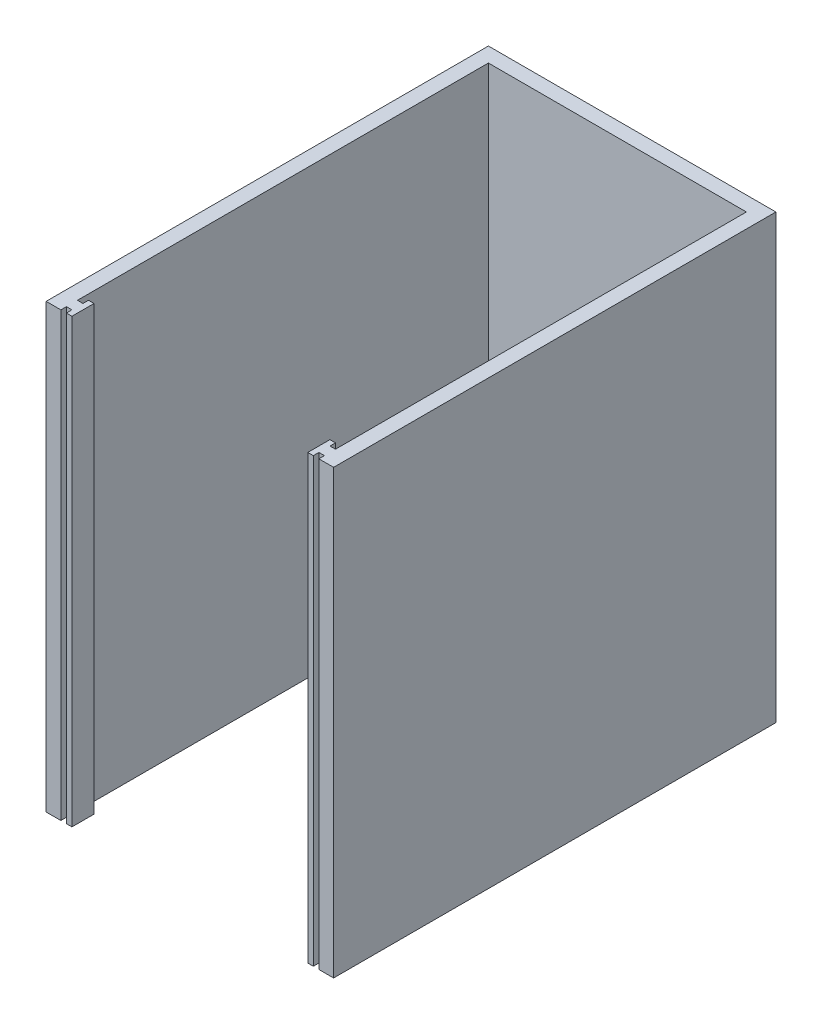
ISO-10303-21;
HEADER;
FILE_DESCRIPTION(('STEP AP214'),'2;1');
FILE_NAME('part.step','',(''),(''),'','','');
FILE_SCHEMA(('AUTOMOTIVE_DESIGN { 1 0 10303 214 1 1 1 1 }'));
ENDSEC;
DATA;
#1=APPLICATION_CONTEXT('core data for automotive mechanical design processes');
#2=APPLICATION_PROTOCOL_DEFINITION('international standard','automotive_design',2000,#1);
#3=PRODUCT_CONTEXT('',#1,'mechanical');
#4=PRODUCT('Part','Part','',(#3));
#5=PRODUCT_RELATED_PRODUCT_CATEGORY('part','',(#4));
#6=PRODUCT_DEFINITION_FORMATION('','',#4);
#7=PRODUCT_DEFINITION_CONTEXT('part definition',#1,'design');
#8=PRODUCT_DEFINITION('design','',#6,#7);
#9=PRODUCT_DEFINITION_SHAPE('','',#8);
#10=(LENGTH_UNIT() NAMED_UNIT(*) SI_UNIT(.MILLI.,.METRE.));
#11=(NAMED_UNIT(*) PLANE_ANGLE_UNIT() SI_UNIT($,.RADIAN.));
#12=(NAMED_UNIT(*) SI_UNIT($,.STERADIAN.) SOLID_ANGLE_UNIT());
#13=UNCERTAINTY_MEASURE_WITH_UNIT(LENGTH_MEASURE(1.E-05),#10,'distance_accuracy_value','');
#14=(GEOMETRIC_REPRESENTATION_CONTEXT(3) GLOBAL_UNCERTAINTY_ASSIGNED_CONTEXT((#13)) GLOBAL_UNIT_ASSIGNED_CONTEXT((#10,
#11,#12)) REPRESENTATION_CONTEXT('',''));
#15=CARTESIAN_POINT('',(0.,0.,0.));
#16=DIRECTION('',(0.,0.,1.));
#17=DIRECTION('',(1.,0.,0.));
#18=AXIS2_PLACEMENT_3D('',#15,#16,#17);
#19=CARTESIAN_POINT('',(0.,120.,0.));
#20=DIRECTION('',(1.,0.,0.));
#21=DIRECTION('',(0.,0.,-1.));
#22=AXIS2_PLACEMENT_3D('',#19,#20,#21);
#23=PLANE('',#22);
#24=DIRECTION('',(0.,0.,1.));
#25=VECTOR('',#24,1.);
#26=CARTESIAN_POINT('',(0.,0.,0.));
#27=LINE('',#26,#25);
#28=CARTESIAN_POINT('',(0.,0.,0.));
#29=VERTEX_POINT('',#28);
#30=CARTESIAN_POINT('',(0.,0.,120.));
#31=VERTEX_POINT('',#30);
#32=EDGE_CURVE('E236',#29,#31,#27,.T.);
#33=ORIENTED_EDGE('',*,*,#32,.T.);
#34=DIRECTION('',(0.,-1.,0.));
#35=VECTOR('',#34,1.);
#36=CARTESIAN_POINT('',(0.,120.,120.));
#37=LINE('',#36,#35);
#38=CARTESIAN_POINT('',(0.,120.,120.));
#39=VERTEX_POINT('',#38);
#40=EDGE_CURVE('E11',#39,#31,#37,.T.);
#41=ORIENTED_EDGE('',*,*,#40,.F.);
#42=DIRECTION('',(0.,0.,1.));
#43=VECTOR('',#42,1.);
#44=CARTESIAN_POINT('',(0.,120.,0.));
#45=LINE('',#44,#43);
#46=CARTESIAN_POINT('',(0.,120.,0.));
#47=VERTEX_POINT('',#46);
#48=EDGE_CURVE('E306',#47,#39,#45,.T.);
#49=ORIENTED_EDGE('',*,*,#48,.F.);
#50=DIRECTION('',(0.,-1.,0.));
#51=VECTOR('',#50,1.);
#52=CARTESIAN_POINT('',(0.,120.,0.));
#53=LINE('',#52,#51);
#54=EDGE_CURVE('E232',#47,#29,#53,.T.);
#55=ORIENTED_EDGE('',*,*,#54,.T.);
#56=EDGE_LOOP('',(#33,#41,#49,#55));
#57=FACE_BOUND('',#56,.T.);
#58=ADVANCED_FACE('F39',(#57),#23,.F.);
#59=CARTESIAN_POINT('',(0.,120.,120.));
#60=DIRECTION('',(0.,0.,-1.));
#61=DIRECTION('',(-1.,0.,0.));
#62=AXIS2_PLACEMENT_3D('',#59,#60,#61);
#63=PLANE('',#62);
#64=DIRECTION('',(1.,0.,0.));
#65=VECTOR('',#64,1.);
#66=CARTESIAN_POINT('',(0.,0.,120.));
#67=LINE('',#66,#65);
#68=CARTESIAN_POINT('',(4.00000000000001,0.,120.));
#69=VERTEX_POINT('',#68);
#70=EDGE_CURVE('E240',#31,#69,#67,.T.);
#71=ORIENTED_EDGE('',*,*,#70,.T.);
#72=DIRECTION('',(0.,-1.,0.));
#73=VECTOR('',#72,1.);
#74=CARTESIAN_POINT('',(4.00000000000001,120.,120.));
#75=LINE('',#74,#73);
#76=CARTESIAN_POINT('',(4.00000000000001,120.,120.));
#77=VERTEX_POINT('',#76);
#78=EDGE_CURVE('E48',#77,#69,#75,.T.);
#79=ORIENTED_EDGE('',*,*,#78,.F.);
#80=DIRECTION('',(1.,0.,0.));
#81=VECTOR('',#80,1.);
#82=CARTESIAN_POINT('',(0.,120.,120.));
#83=LINE('',#82,#81);
#84=EDGE_CURVE('E147',#39,#77,#83,.T.);
#85=ORIENTED_EDGE('',*,*,#84,.F.);
#86=ORIENTED_EDGE('',*,*,#40,.T.);
#87=EDGE_LOOP('',(#71,#79,#85,#86));
#88=FACE_BOUND('',#87,.T.);
#89=ADVANCED_FACE('F484',(#88),#63,.F.);
#90=CARTESIAN_POINT('',(4.00000000000001,120.,120.));
#91=DIRECTION('',(-1.,0.,0.));
#92=DIRECTION('',(0.,0.,1.));
#93=AXIS2_PLACEMENT_3D('',#90,#91,#92);
#94=PLANE('',#93);
#95=DIRECTION('',(0.,0.,-1.));
#96=VECTOR('',#95,1.);
#97=CARTESIAN_POINT('',(4.00000000000001,0.,120.));
#98=LINE('',#97,#96);
#99=CARTESIAN_POINT('',(4.00000000000002,0.,118.5));
#100=VERTEX_POINT('',#99);
#101=EDGE_CURVE('E243',#69,#100,#98,.T.);
#102=ORIENTED_EDGE('',*,*,#101,.T.);
#103=DIRECTION('',(0.,-1.,0.));
#104=VECTOR('',#103,1.);
#105=CARTESIAN_POINT('',(4.00000000000002,120.,118.5));
#106=LINE('',#105,#104);
#107=CARTESIAN_POINT('',(4.00000000000002,120.,118.5));
#108=VERTEX_POINT('',#107);
#109=EDGE_CURVE('E381',#108,#100,#106,.T.);
#110=ORIENTED_EDGE('',*,*,#109,.F.);
#111=DIRECTION('',(0.,0.,-1.));
#112=VECTOR('',#111,1.);
#113=CARTESIAN_POINT('',(4.00000000000001,120.,120.));
#114=LINE('',#113,#112);
#115=EDGE_CURVE('E391',#77,#108,#114,.T.);
#116=ORIENTED_EDGE('',*,*,#115,.F.);
#117=ORIENTED_EDGE('',*,*,#78,.T.);
#118=EDGE_LOOP('',(#102,#110,#116,#117));
#119=FACE_BOUND('',#118,.T.);
#120=ADVANCED_FACE('F389',(#119),#94,.F.);
#121=CARTESIAN_POINT('',(5.50000000000002,120.,118.5));
#122=DIRECTION('',(0.,0.,-1.));
#123=DIRECTION('',(-1.,0.,0.));
#124=AXIS2_PLACEMENT_3D('',#121,#122,#123);
#125=PLANE('',#124);
#126=DIRECTION('',(1.,0.,0.));
#127=VECTOR('',#126,1.);
#128=CARTESIAN_POINT('',(5.50000000000002,0.,118.5));
#129=LINE('',#128,#127);
#130=CARTESIAN_POINT('',(5.50000000000002,0.,118.5));
#131=VERTEX_POINT('',#130);
#132=EDGE_CURVE('E246',#100,#131,#129,.T.);
#133=ORIENTED_EDGE('',*,*,#132,.T.);
#134=DIRECTION('',(0.,-1.,0.));
#135=VECTOR('',#134,1.);
#136=CARTESIAN_POINT('',(5.50000000000002,120.,118.5));
#137=LINE('',#136,#135);
#138=CARTESIAN_POINT('',(5.50000000000002,120.,118.5));
#139=VERTEX_POINT('',#138);
#140=EDGE_CURVE('E377',#139,#131,#137,.T.);
#141=ORIENTED_EDGE('',*,*,#140,.F.);
#142=DIRECTION('',(1.,0.,0.));
#143=VECTOR('',#142,1.);
#144=CARTESIAN_POINT('',(5.50000000000002,120.,118.5));
#145=LINE('',#144,#143);
#146=EDGE_CURVE('E410',#108,#139,#145,.T.);
#147=ORIENTED_EDGE('',*,*,#146,.F.);
#148=ORIENTED_EDGE('',*,*,#109,.T.);
#149=EDGE_LOOP('',(#133,#141,#147,#148));
#150=FACE_BOUND('',#149,.T.);
#151=ADVANCED_FACE('F400',(#150),#125,.F.);
#152=CARTESIAN_POINT('',(5.50000000000002,120.,120.));
#153=DIRECTION('',(1.,0.,0.));
#154=DIRECTION('',(0.,0.,-1.));
#155=AXIS2_PLACEMENT_3D('',#152,#153,#154);
#156=PLANE('',#155);
#157=DIRECTION('',(0.,0.,1.));
#158=VECTOR('',#157,1.);
#159=CARTESIAN_POINT('',(5.50000000000002,0.,120.));
#160=LINE('',#159,#158);
#161=CARTESIAN_POINT('',(5.50000000000002,0.,120.));
#162=VERTEX_POINT('',#161);
#163=EDGE_CURVE('E249',#131,#162,#160,.T.);
#164=ORIENTED_EDGE('',*,*,#163,.T.);
#165=DIRECTION('',(0.,-1.,0.));
#166=VECTOR('',#165,1.);
#167=CARTESIAN_POINT('',(5.50000000000002,120.,120.));
#168=LINE('',#167,#166);
#169=CARTESIAN_POINT('',(5.50000000000002,120.,120.));
#170=VERTEX_POINT('',#169);
#171=EDGE_CURVE('E373',#170,#162,#168,.T.);
#172=ORIENTED_EDGE('',*,*,#171,.F.);
#173=DIRECTION('',(0.,0.,1.));
#174=VECTOR('',#173,1.);
#175=CARTESIAN_POINT('',(5.50000000000002,120.,120.));
#176=LINE('',#175,#174);
#177=EDGE_CURVE('E406',#139,#170,#176,.T.);
#178=ORIENTED_EDGE('',*,*,#177,.F.);
#179=ORIENTED_EDGE('',*,*,#140,.T.);
#180=EDGE_LOOP('',(#164,#172,#178,#179));
#181=FACE_BOUND('',#180,.T.);
#182=ADVANCED_FACE('F404',(#181),#156,.F.);
#183=CARTESIAN_POINT('',(5.50000000000002,120.,120.));
#184=DIRECTION('',(0.,0.,-1.));
#185=DIRECTION('',(-1.,0.,0.));
#186=AXIS2_PLACEMENT_3D('',#183,#184,#185);
#187=PLANE('',#186);
#188=DIRECTION('',(1.,0.,0.));
#189=VECTOR('',#188,1.);
#190=CARTESIAN_POINT('',(5.50000000000002,0.,120.));
#191=LINE('',#190,#189);
#192=CARTESIAN_POINT('',(7.00000000000002,0.,120.));
#193=VERTEX_POINT('',#192);
#194=EDGE_CURVE('E252',#162,#193,#191,.T.);
#195=ORIENTED_EDGE('',*,*,#194,.T.);
#196=DIRECTION('',(0.,-1.,0.));
#197=VECTOR('',#196,1.);
#198=CARTESIAN_POINT('',(7.00000000000002,120.,120.));
#199=LINE('',#198,#197);
#200=CARTESIAN_POINT('',(7.00000000000002,120.,120.));
#201=VERTEX_POINT('',#200);
#202=EDGE_CURVE('E369',#201,#193,#199,.T.);
#203=ORIENTED_EDGE('',*,*,#202,.F.);
#204=DIRECTION('',(1.,0.,0.));
#205=VECTOR('',#204,1.);
#206=CARTESIAN_POINT('',(5.50000000000002,120.,120.));
#207=LINE('',#206,#205);
#208=EDGE_CURVE('E409',#170,#201,#207,.T.);
#209=ORIENTED_EDGE('',*,*,#208,.F.);
#210=ORIENTED_EDGE('',*,*,#171,.T.);
#211=EDGE_LOOP('',(#195,#203,#209,#210));
#212=FACE_BOUND('',#211,.T.);
#213=ADVANCED_FACE('F497',(#212),#187,.F.);
#214=CARTESIAN_POINT('',(7.00000000000002,120.,120.));
#215=DIRECTION('',(-1.,0.,0.));
#216=DIRECTION('',(0.,0.,1.));
#217=AXIS2_PLACEMENT_3D('',#214,#215,#216);
#218=PLANE('',#217);
#219=DIRECTION('',(0.,0.,-1.));
#220=VECTOR('',#219,1.);
#221=CARTESIAN_POINT('',(7.00000000000002,0.,120.));
#222=LINE('',#221,#220);
#223=CARTESIAN_POINT('',(7.00000000000002,0.,114.));
#224=VERTEX_POINT('',#223);
#225=EDGE_CURVE('E255',#193,#224,#222,.T.);
#226=ORIENTED_EDGE('',*,*,#225,.T.);
#227=DIRECTION('',(0.,-1.,0.));
#228=VECTOR('',#227,1.);
#229=CARTESIAN_POINT('',(7.00000000000002,120.,114.));
#230=LINE('',#229,#228);
#231=CARTESIAN_POINT('',(7.00000000000002,120.,114.));
#232=VERTEX_POINT('',#231);
#233=EDGE_CURVE('E365',#232,#224,#230,.T.);
#234=ORIENTED_EDGE('',*,*,#233,.F.);
#235=DIRECTION('',(0.,0.,-1.));
#236=VECTOR('',#235,1.);
#237=CARTESIAN_POINT('',(7.00000000000002,120.,120.));
#238=LINE('',#237,#236);
#239=EDGE_CURVE('E414',#201,#232,#238,.T.);
#240=ORIENTED_EDGE('',*,*,#239,.F.);
#241=ORIENTED_EDGE('',*,*,#202,.T.);
#242=EDGE_LOOP('',(#226,#234,#240,#241));
#243=FACE_BOUND('',#242,.T.);
#244=ADVANCED_FACE('F500',(#243),#218,.F.);
#245=CARTESIAN_POINT('',(5.50000000000001,120.,114.));
#246=DIRECTION('',(0.,0.,1.));
#247=DIRECTION('',(1.,0.,0.));
#248=AXIS2_PLACEMENT_3D('',#245,#246,#247);
#249=PLANE('',#248);
#250=DIRECTION('',(-1.,0.,0.));
#251=VECTOR('',#250,1.);
#252=CARTESIAN_POINT('',(5.50000000000001,0.,114.));
#253=LINE('',#252,#251);
#254=CARTESIAN_POINT('',(5.50000000000001,0.,114.));
#255=VERTEX_POINT('',#254);
#256=EDGE_CURVE('E258',#224,#255,#253,.T.);
#257=ORIENTED_EDGE('',*,*,#256,.T.);
#258=DIRECTION('',(0.,-1.,0.));
#259=VECTOR('',#258,1.);
#260=CARTESIAN_POINT('',(5.50000000000001,120.,114.));
#261=LINE('',#260,#259);
#262=CARTESIAN_POINT('',(5.50000000000001,120.,114.));
#263=VERTEX_POINT('',#262);
#264=EDGE_CURVE('E361',#263,#255,#261,.T.);
#265=ORIENTED_EDGE('',*,*,#264,.F.);
#266=DIRECTION('',(-1.,0.,0.));
#267=VECTOR('',#266,1.);
#268=CARTESIAN_POINT('',(5.50000000000001,120.,114.));
#269=LINE('',#268,#267);
#270=EDGE_CURVE('E421',#232,#263,#269,.T.);
#271=ORIENTED_EDGE('',*,*,#270,.F.);
#272=ORIENTED_EDGE('',*,*,#233,.T.);
#273=EDGE_LOOP('',(#257,#265,#271,#272));
#274=FACE_BOUND('',#273,.T.);
#275=ADVANCED_FACE('F504',(#274),#249,.F.);
#276=CARTESIAN_POINT('',(5.50000000000001,120.,114.));
#277=DIRECTION('',(1.,0.,0.));
#278=DIRECTION('',(0.,0.,-1.));
#279=AXIS2_PLACEMENT_3D('',#276,#277,#278);
#280=PLANE('',#279);
#281=DIRECTION('',(0.,0.,1.));
#282=VECTOR('',#281,1.);
#283=CARTESIAN_POINT('',(5.50000000000001,0.,114.));
#284=LINE('',#283,#282);
#285=CARTESIAN_POINT('',(5.50000000000001,0.,115.5));
#286=VERTEX_POINT('',#285);
#287=EDGE_CURVE('E261',#255,#286,#284,.T.);
#288=ORIENTED_EDGE('',*,*,#287,.T.);
#289=DIRECTION('',(0.,-1.,0.));
#290=VECTOR('',#289,1.);
#291=CARTESIAN_POINT('',(5.50000000000001,120.,115.5));
#292=LINE('',#291,#290);
#293=CARTESIAN_POINT('',(5.50000000000001,120.,115.5));
#294=VERTEX_POINT('',#293);
#295=EDGE_CURVE('E357',#294,#286,#292,.T.);
#296=ORIENTED_EDGE('',*,*,#295,.F.);
#297=DIRECTION('',(0.,0.,1.));
#298=VECTOR('',#297,1.);
#299=CARTESIAN_POINT('',(5.50000000000001,120.,114.));
#300=LINE('',#299,#298);
#301=EDGE_CURVE('E424',#263,#294,#300,.T.);
#302=ORIENTED_EDGE('',*,*,#301,.F.);
#303=ORIENTED_EDGE('',*,*,#264,.T.);
#304=EDGE_LOOP('',(#288,#296,#302,#303));
#305=FACE_BOUND('',#304,.T.);
#306=ADVANCED_FACE('F508',(#305),#280,.F.);
#307=CARTESIAN_POINT('',(5.50000000000001,120.,115.5));
#308=DIRECTION('',(0.,0.,1.));
#309=DIRECTION('',(1.,0.,0.));
#310=AXIS2_PLACEMENT_3D('',#307,#308,#309);
#311=PLANE('',#310);
#312=DIRECTION('',(-1.,0.,0.));
#313=VECTOR('',#312,1.);
#314=CARTESIAN_POINT('',(5.50000000000001,0.,115.5));
#315=LINE('',#314,#313);
#316=CARTESIAN_POINT('',(4.00000000000002,0.,115.5));
#317=VERTEX_POINT('',#316);
#318=EDGE_CURVE('E264',#286,#317,#315,.T.);
#319=ORIENTED_EDGE('',*,*,#318,.T.);
#320=DIRECTION('',(0.,-1.,0.));
#321=VECTOR('',#320,1.);
#322=CARTESIAN_POINT('',(4.00000000000002,120.,115.5));
#323=LINE('',#322,#321);
#324=CARTESIAN_POINT('',(4.00000000000002,120.,115.5));
#325=VERTEX_POINT('',#324);
#326=EDGE_CURVE('E353',#325,#317,#323,.T.);
#327=ORIENTED_EDGE('',*,*,#326,.F.);
#328=DIRECTION('',(-1.,0.,0.));
#329=VECTOR('',#328,1.);
#330=CARTESIAN_POINT('',(5.50000000000001,120.,115.5));
#331=LINE('',#330,#329);
#332=EDGE_CURVE('E427',#294,#325,#331,.T.);
#333=ORIENTED_EDGE('',*,*,#332,.F.);
#334=ORIENTED_EDGE('',*,*,#295,.T.);
#335=EDGE_LOOP('',(#319,#327,#333,#334));
#336=FACE_BOUND('',#335,.T.);
#337=ADVANCED_FACE('F512',(#336),#311,.F.);
#338=CARTESIAN_POINT('',(4.00000000000002,120.,115.5));
#339=DIRECTION('',(-1.,0.,0.));
#340=DIRECTION('',(0.,0.,1.));
#341=AXIS2_PLACEMENT_3D('',#338,#339,#340);
#342=PLANE('',#341);
#343=DIRECTION('',(0.,0.,-1.));
#344=VECTOR('',#343,1.);
#345=CARTESIAN_POINT('',(4.00000000000002,0.,115.5));
#346=LINE('',#345,#344);
#347=CARTESIAN_POINT('',(4.00000000000002,0.,4.));
#348=VERTEX_POINT('',#347);
#349=EDGE_CURVE('E267',#317,#348,#346,.T.);
#350=ORIENTED_EDGE('',*,*,#349,.T.);
#351=DIRECTION('',(0.,-1.,0.));
#352=VECTOR('',#351,1.);
#353=CARTESIAN_POINT('',(4.00000000000002,120.,4.));
#354=LINE('',#353,#352);
#355=CARTESIAN_POINT('',(4.00000000000002,120.,4.));
#356=VERTEX_POINT('',#355);
#357=EDGE_CURVE('E349',#356,#348,#354,.T.);
#358=ORIENTED_EDGE('',*,*,#357,.F.);
#359=DIRECTION('',(0.,0.,-1.));
#360=VECTOR('',#359,1.);
#361=CARTESIAN_POINT('',(4.00000000000002,120.,115.5));
#362=LINE('',#361,#360);
#363=EDGE_CURVE('E430',#325,#356,#362,.T.);
#364=ORIENTED_EDGE('',*,*,#363,.F.);
#365=ORIENTED_EDGE('',*,*,#326,.T.);
#366=EDGE_LOOP('',(#350,#358,#364,#365));
#367=FACE_BOUND('',#366,.T.);
#368=ADVANCED_FACE('F516',(#367),#342,.F.);
#369=CARTESIAN_POINT('',(4.00000000000002,120.,4.));
#370=DIRECTION('',(0.,0.,-1.));
#371=DIRECTION('',(-1.,0.,0.));
#372=AXIS2_PLACEMENT_3D('',#369,#370,#371);
#373=PLANE('',#372);
#374=DIRECTION('',(1.,0.,0.));
#375=VECTOR('',#374,1.);
#376=CARTESIAN_POINT('',(4.00000000000002,0.,4.));
#377=LINE('',#376,#375);
#378=CARTESIAN_POINT('',(74.,0.,4.));
#379=VERTEX_POINT('',#378);
#380=EDGE_CURVE('E270',#348,#379,#377,.T.);
#381=ORIENTED_EDGE('',*,*,#380,.T.);
#382=DIRECTION('',(0.,-1.,0.));
#383=VECTOR('',#382,1.);
#384=CARTESIAN_POINT('',(74.,120.,4.));
#385=LINE('',#384,#383);
#386=CARTESIAN_POINT('',(74.,120.,4.));
#387=VERTEX_POINT('',#386);
#388=EDGE_CURVE('E345',#387,#379,#385,.T.);
#389=ORIENTED_EDGE('',*,*,#388,.F.);
#390=DIRECTION('',(1.,0.,0.));
#391=VECTOR('',#390,1.);
#392=CARTESIAN_POINT('',(4.00000000000002,120.,4.));
#393=LINE('',#392,#391);
#394=EDGE_CURVE('E433',#356,#387,#393,.T.);
#395=ORIENTED_EDGE('',*,*,#394,.F.);
#396=ORIENTED_EDGE('',*,*,#357,.T.);
#397=EDGE_LOOP('',(#381,#389,#395,#396));
#398=FACE_BOUND('',#397,.T.);
#399=ADVANCED_FACE('F520',(#398),#373,.F.);
#400=CARTESIAN_POINT('',(74.,120.,115.5));
#401=DIRECTION('',(1.,0.,0.));
#402=DIRECTION('',(0.,0.,-1.));
#403=AXIS2_PLACEMENT_3D('',#400,#401,#402);
#404=PLANE('',#403);
#405=DIRECTION('',(0.,0.,1.));
#406=VECTOR('',#405,1.);
#407=CARTESIAN_POINT('',(74.,0.,115.5));
#408=LINE('',#407,#406);
#409=CARTESIAN_POINT('',(74.,0.,115.5));
#410=VERTEX_POINT('',#409);
#411=EDGE_CURVE('E273',#379,#410,#408,.T.);
#412=ORIENTED_EDGE('',*,*,#411,.T.);
#413=DIRECTION('',(0.,-1.,0.));
#414=VECTOR('',#413,1.);
#415=CARTESIAN_POINT('',(74.,120.,115.5));
#416=LINE('',#415,#414);
#417=CARTESIAN_POINT('',(74.,120.,115.5));
#418=VERTEX_POINT('',#417);
#419=EDGE_CURVE('E341',#418,#410,#416,.T.);
#420=ORIENTED_EDGE('',*,*,#419,.F.);
#421=DIRECTION('',(0.,0.,1.));
#422=VECTOR('',#421,1.);
#423=CARTESIAN_POINT('',(74.,120.,115.5));
#424=LINE('',#423,#422);
#425=EDGE_CURVE('E436',#387,#418,#424,.T.);
#426=ORIENTED_EDGE('',*,*,#425,.F.);
#427=ORIENTED_EDGE('',*,*,#388,.T.);
#428=EDGE_LOOP('',(#412,#420,#426,#427));
#429=FACE_BOUND('',#428,.T.);
#430=ADVANCED_FACE('F524',(#429),#404,.F.);
#431=CARTESIAN_POINT('',(72.5,120.,115.5));
#432=DIRECTION('',(0.,0.,1.));
#433=DIRECTION('',(1.,0.,0.));
#434=AXIS2_PLACEMENT_3D('',#431,#432,#433);
#435=PLANE('',#434);
#436=DIRECTION('',(-1.,0.,0.));
#437=VECTOR('',#436,1.);
#438=CARTESIAN_POINT('',(72.5,0.,115.5));
#439=LINE('',#438,#437);
#440=CARTESIAN_POINT('',(72.5,0.,115.5));
#441=VERTEX_POINT('',#440);
#442=EDGE_CURVE('E276',#410,#441,#439,.T.);
#443=ORIENTED_EDGE('',*,*,#442,.T.);
#444=DIRECTION('',(0.,-1.,0.));
#445=VECTOR('',#444,1.);
#446=CARTESIAN_POINT('',(72.5,120.,115.5));
#447=LINE('',#446,#445);
#448=CARTESIAN_POINT('',(72.5,120.,115.5));
#449=VERTEX_POINT('',#448);
#450=EDGE_CURVE('E337',#449,#441,#447,.T.);
#451=ORIENTED_EDGE('',*,*,#450,.F.);
#452=DIRECTION('',(-1.,0.,0.));
#453=VECTOR('',#452,1.);
#454=CARTESIAN_POINT('',(72.5,120.,115.5));
#455=LINE('',#454,#453);
#456=EDGE_CURVE('E439',#418,#449,#455,.T.);
#457=ORIENTED_EDGE('',*,*,#456,.F.);
#458=ORIENTED_EDGE('',*,*,#419,.T.);
#459=EDGE_LOOP('',(#443,#451,#457,#458));
#460=FACE_BOUND('',#459,.T.);
#461=ADVANCED_FACE('F528',(#460),#435,.F.);
#462=CARTESIAN_POINT('',(72.5,120.,114.));
#463=DIRECTION('',(-1.,0.,0.));
#464=DIRECTION('',(0.,0.,1.));
#465=AXIS2_PLACEMENT_3D('',#462,#463,#464);
#466=PLANE('',#465);
#467=DIRECTION('',(0.,0.,-1.));
#468=VECTOR('',#467,1.);
#469=CARTESIAN_POINT('',(72.5,0.,114.));
#470=LINE('',#469,#468);
#471=CARTESIAN_POINT('',(72.5,0.,114.));
#472=VERTEX_POINT('',#471);
#473=EDGE_CURVE('E279',#441,#472,#470,.T.);
#474=ORIENTED_EDGE('',*,*,#473,.T.);
#475=DIRECTION('',(0.,-1.,0.));
#476=VECTOR('',#475,1.);
#477=CARTESIAN_POINT('',(72.5,120.,114.));
#478=LINE('',#477,#476);
#479=CARTESIAN_POINT('',(72.5,120.,114.));
#480=VERTEX_POINT('',#479);
#481=EDGE_CURVE('E333',#480,#472,#478,.T.);
#482=ORIENTED_EDGE('',*,*,#481,.F.);
#483=DIRECTION('',(0.,0.,-1.));
#484=VECTOR('',#483,1.);
#485=CARTESIAN_POINT('',(72.5,120.,114.));
#486=LINE('',#485,#484);
#487=EDGE_CURVE('E442',#449,#480,#486,.T.);
#488=ORIENTED_EDGE('',*,*,#487,.F.);
#489=ORIENTED_EDGE('',*,*,#450,.T.);
#490=EDGE_LOOP('',(#474,#482,#488,#489));
#491=FACE_BOUND('',#490,.T.);
#492=ADVANCED_FACE('F532',(#491),#466,.F.);
#493=CARTESIAN_POINT('',(72.5,120.,114.));
#494=DIRECTION('',(0.,0.,1.));
#495=DIRECTION('',(1.,0.,0.));
#496=AXIS2_PLACEMENT_3D('',#493,#494,#495);
#497=PLANE('',#496);
#498=DIRECTION('',(-1.,0.,0.));
#499=VECTOR('',#498,1.);
#500=CARTESIAN_POINT('',(72.5,0.,114.));
#501=LINE('',#500,#499);
#502=CARTESIAN_POINT('',(71.,0.,114.));
#503=VERTEX_POINT('',#502);
#504=EDGE_CURVE('E282',#472,#503,#501,.T.);
#505=ORIENTED_EDGE('',*,*,#504,.T.);
#506=DIRECTION('',(0.,-1.,0.));
#507=VECTOR('',#506,1.);
#508=CARTESIAN_POINT('',(71.,120.,114.));
#509=LINE('',#508,#507);
#510=CARTESIAN_POINT('',(71.,120.,114.));
#511=VERTEX_POINT('',#510);
#512=EDGE_CURVE('E329',#511,#503,#509,.T.);
#513=ORIENTED_EDGE('',*,*,#512,.F.);
#514=DIRECTION('',(-1.,0.,0.));
#515=VECTOR('',#514,1.);
#516=CARTESIAN_POINT('',(72.5,120.,114.));
#517=LINE('',#516,#515);
#518=EDGE_CURVE('E445',#480,#511,#517,.T.);
#519=ORIENTED_EDGE('',*,*,#518,.F.);
#520=ORIENTED_EDGE('',*,*,#481,.T.);
#521=EDGE_LOOP('',(#505,#513,#519,#520));
#522=FACE_BOUND('',#521,.T.);
#523=ADVANCED_FACE('F536',(#522),#497,.F.);
#524=CARTESIAN_POINT('',(71.,120.,120.));
#525=DIRECTION('',(1.,0.,0.));
#526=DIRECTION('',(0.,0.,-1.));
#527=AXIS2_PLACEMENT_3D('',#524,#525,#526);
#528=PLANE('',#527);
#529=DIRECTION('',(0.,0.,1.));
#530=VECTOR('',#529,1.);
#531=CARTESIAN_POINT('',(71.,0.,120.));
#532=LINE('',#531,#530);
#533=CARTESIAN_POINT('',(71.,0.,120.));
#534=VERTEX_POINT('',#533);
#535=EDGE_CURVE('E285',#503,#534,#532,.T.);
#536=ORIENTED_EDGE('',*,*,#535,.T.);
#537=DIRECTION('',(0.,-1.,0.));
#538=VECTOR('',#537,1.);
#539=CARTESIAN_POINT('',(71.,120.,120.));
#540=LINE('',#539,#538);
#541=CARTESIAN_POINT('',(71.,120.,120.));
#542=VERTEX_POINT('',#541);
#543=EDGE_CURVE('E325',#542,#534,#540,.T.);
#544=ORIENTED_EDGE('',*,*,#543,.F.);
#545=DIRECTION('',(0.,0.,1.));
#546=VECTOR('',#545,1.);
#547=CARTESIAN_POINT('',(71.,120.,120.));
#548=LINE('',#547,#546);
#549=EDGE_CURVE('E448',#511,#542,#548,.T.);
#550=ORIENTED_EDGE('',*,*,#549,.F.);
#551=ORIENTED_EDGE('',*,*,#512,.T.);
#552=EDGE_LOOP('',(#536,#544,#550,#551));
#553=FACE_BOUND('',#552,.T.);
#554=ADVANCED_FACE('F540',(#553),#528,.F.);
#555=CARTESIAN_POINT('',(72.5,120.,120.));
#556=DIRECTION('',(0.,0.,-1.));
#557=DIRECTION('',(-1.,0.,0.));
#558=AXIS2_PLACEMENT_3D('',#555,#556,#557);
#559=PLANE('',#558);
#560=DIRECTION('',(1.,0.,0.));
#561=VECTOR('',#560,1.);
#562=CARTESIAN_POINT('',(72.5,0.,120.));
#563=LINE('',#562,#561);
#564=CARTESIAN_POINT('',(72.5,0.,120.));
#565=VERTEX_POINT('',#564);
#566=EDGE_CURVE('E288',#534,#565,#563,.T.);
#567=ORIENTED_EDGE('',*,*,#566,.T.);
#568=DIRECTION('',(0.,-1.,0.));
#569=VECTOR('',#568,1.);
#570=CARTESIAN_POINT('',(72.5,120.,120.));
#571=LINE('',#570,#569);
#572=CARTESIAN_POINT('',(72.5,120.,120.));
#573=VERTEX_POINT('',#572);
#574=EDGE_CURVE('E321',#573,#565,#571,.T.);
#575=ORIENTED_EDGE('',*,*,#574,.F.);
#576=DIRECTION('',(1.,0.,0.));
#577=VECTOR('',#576,1.);
#578=CARTESIAN_POINT('',(72.5,120.,120.));
#579=LINE('',#578,#577);
#580=EDGE_CURVE('E451',#542,#573,#579,.T.);
#581=ORIENTED_EDGE('',*,*,#580,.F.);
#582=ORIENTED_EDGE('',*,*,#543,.T.);
#583=EDGE_LOOP('',(#567,#575,#581,#582));
#584=FACE_BOUND('',#583,.T.);
#585=ADVANCED_FACE('F544',(#584),#559,.F.);
#586=CARTESIAN_POINT('',(72.5,120.,120.));
#587=DIRECTION('',(-1.,0.,0.));
#588=DIRECTION('',(0.,0.,1.));
#589=AXIS2_PLACEMENT_3D('',#586,#587,#588);
#590=PLANE('',#589);
#591=DIRECTION('',(0.,0.,-1.));
#592=VECTOR('',#591,1.);
#593=CARTESIAN_POINT('',(72.5,0.,120.));
#594=LINE('',#593,#592);
#595=CARTESIAN_POINT('',(72.5,0.,118.5));
#596=VERTEX_POINT('',#595);
#597=EDGE_CURVE('E291',#565,#596,#594,.T.);
#598=ORIENTED_EDGE('',*,*,#597,.T.);
#599=DIRECTION('',(0.,-1.,0.));
#600=VECTOR('',#599,1.);
#601=CARTESIAN_POINT('',(72.5,120.,118.5));
#602=LINE('',#601,#600);
#603=CARTESIAN_POINT('',(72.5,120.,118.5));
#604=VERTEX_POINT('',#603);
#605=EDGE_CURVE('E317',#604,#596,#602,.T.);
#606=ORIENTED_EDGE('',*,*,#605,.F.);
#607=DIRECTION('',(0.,0.,-1.));
#608=VECTOR('',#607,1.);
#609=CARTESIAN_POINT('',(72.5,120.,120.));
#610=LINE('',#609,#608);
#611=EDGE_CURVE('E454',#573,#604,#610,.T.);
#612=ORIENTED_EDGE('',*,*,#611,.F.);
#613=ORIENTED_EDGE('',*,*,#574,.T.);
#614=EDGE_LOOP('',(#598,#606,#612,#613));
#615=FACE_BOUND('',#614,.T.);
#616=ADVANCED_FACE('F548',(#615),#590,.F.);
#617=CARTESIAN_POINT('',(72.5,120.,118.5));
#618=DIRECTION('',(0.,0.,-1.));
#619=DIRECTION('',(-1.,0.,0.));
#620=AXIS2_PLACEMENT_3D('',#617,#618,#619);
#621=PLANE('',#620);
#622=DIRECTION('',(1.,0.,0.));
#623=VECTOR('',#622,1.);
#624=CARTESIAN_POINT('',(72.5,0.,118.5));
#625=LINE('',#624,#623);
#626=CARTESIAN_POINT('',(74.,0.,118.5));
#627=VERTEX_POINT('',#626);
#628=EDGE_CURVE('E294',#596,#627,#625,.T.);
#629=ORIENTED_EDGE('',*,*,#628,.T.);
#630=DIRECTION('',(0.,-1.,0.));
#631=VECTOR('',#630,1.);
#632=CARTESIAN_POINT('',(74.,120.,118.5));
#633=LINE('',#632,#631);
#634=CARTESIAN_POINT('',(74.,120.,118.5));
#635=VERTEX_POINT('',#634);
#636=EDGE_CURVE('E313',#635,#627,#633,.T.);
#637=ORIENTED_EDGE('',*,*,#636,.F.);
#638=DIRECTION('',(1.,0.,0.));
#639=VECTOR('',#638,1.);
#640=CARTESIAN_POINT('',(72.5,120.,118.5));
#641=LINE('',#640,#639);
#642=EDGE_CURVE('E457',#604,#635,#641,.T.);
#643=ORIENTED_EDGE('',*,*,#642,.F.);
#644=ORIENTED_EDGE('',*,*,#605,.T.);
#645=EDGE_LOOP('',(#629,#637,#643,#644));
#646=FACE_BOUND('',#645,.T.);
#647=ADVANCED_FACE('F465',(#646),#621,.F.);
#648=CARTESIAN_POINT('',(74.,120.,120.));
#649=DIRECTION('',(1.,0.,0.));
#650=DIRECTION('',(0.,0.,-1.));
#651=AXIS2_PLACEMENT_3D('',#648,#649,#650);
#652=PLANE('',#651);
#653=DIRECTION('',(0.,0.,1.));
#654=VECTOR('',#653,1.);
#655=CARTESIAN_POINT('',(74.,0.,120.));
#656=LINE('',#655,#654);
#657=CARTESIAN_POINT('',(74.,0.,120.));
#658=VERTEX_POINT('',#657);
#659=EDGE_CURVE('E297',#627,#658,#656,.T.);
#660=ORIENTED_EDGE('',*,*,#659,.T.);
#661=DIRECTION('',(0.,-1.,0.));
#662=VECTOR('',#661,1.);
#663=CARTESIAN_POINT('',(74.,120.,120.));
#664=LINE('',#663,#662);
#665=CARTESIAN_POINT('',(74.,120.,120.));
#666=VERTEX_POINT('',#665);
#667=EDGE_CURVE('E225',#666,#658,#664,.T.);
#668=ORIENTED_EDGE('',*,*,#667,.F.);
#669=DIRECTION('',(0.,0.,1.));
#670=VECTOR('',#669,1.);
#671=CARTESIAN_POINT('',(74.,120.,120.));
#672=LINE('',#671,#670);
#673=EDGE_CURVE('E214',#635,#666,#672,.T.);
#674=ORIENTED_EDGE('',*,*,#673,.F.);
#675=ORIENTED_EDGE('',*,*,#636,.T.);
#676=EDGE_LOOP('',(#660,#668,#674,#675));
#677=FACE_BOUND('',#676,.T.);
#678=ADVANCED_FACE('F469',(#677),#652,.F.);
#679=CARTESIAN_POINT('',(74.,120.,120.));
#680=DIRECTION('',(0.,0.,-1.));
#681=DIRECTION('',(-1.,0.,0.));
#682=AXIS2_PLACEMENT_3D('',#679,#680,#681);
#683=PLANE('',#682);
#684=DIRECTION('',(1.,0.,0.));
#685=VECTOR('',#684,1.);
#686=CARTESIAN_POINT('',(74.,0.,120.));
#687=LINE('',#686,#685);
#688=CARTESIAN_POINT('',(78.,0.,120.));
#689=VERTEX_POINT('',#688);
#690=EDGE_CURVE('E223',#658,#689,#687,.T.);
#691=ORIENTED_EDGE('',*,*,#690,.T.);
#692=DIRECTION('',(0.,-1.,0.));
#693=VECTOR('',#692,1.);
#694=CARTESIAN_POINT('',(78.,120.,120.));
#695=LINE('',#694,#693);
#696=CARTESIAN_POINT('',(78.,120.,120.));
#697=VERTEX_POINT('',#696);
#698=EDGE_CURVE('E220',#697,#689,#695,.T.);
#699=ORIENTED_EDGE('',*,*,#698,.F.);
#700=DIRECTION('',(1.,0.,0.));
#701=VECTOR('',#700,1.);
#702=CARTESIAN_POINT('',(74.,120.,120.));
#703=LINE('',#702,#701);
#704=EDGE_CURVE('E208',#666,#697,#703,.T.);
#705=ORIENTED_EDGE('',*,*,#704,.F.);
#706=ORIENTED_EDGE('',*,*,#667,.T.);
#707=EDGE_LOOP('',(#691,#699,#705,#706));
#708=FACE_BOUND('',#707,.T.);
#709=ADVANCED_FACE('F221',(#708),#683,.F.);
#710=CARTESIAN_POINT('',(78.,120.,0.));
#711=DIRECTION('',(-1.,0.,0.));
#712=DIRECTION('',(0.,0.,1.));
#713=AXIS2_PLACEMENT_3D('',#710,#711,#712);
#714=PLANE('',#713);
#715=DIRECTION('',(0.,0.,-1.));
#716=VECTOR('',#715,1.);
#717=CARTESIAN_POINT('',(78.,0.,0.));
#718=LINE('',#717,#716);
#719=CARTESIAN_POINT('',(78.,0.,0.));
#720=VERTEX_POINT('',#719);
#721=EDGE_CURVE('E133',#689,#720,#718,.T.);
#722=ORIENTED_EDGE('',*,*,#721,.T.);
#723=DIRECTION('',(0.,-1.,0.));
#724=VECTOR('',#723,1.);
#725=CARTESIAN_POINT('',(78.,120.,0.));
#726=LINE('',#725,#724);
#727=CARTESIAN_POINT('',(78.,120.,0.));
#728=VERTEX_POINT('',#727);
#729=EDGE_CURVE('E226',#728,#720,#726,.T.);
#730=ORIENTED_EDGE('',*,*,#729,.F.);
#731=DIRECTION('',(0.,0.,-1.));
#732=VECTOR('',#731,1.);
#733=CARTESIAN_POINT('',(78.,120.,0.));
#734=LINE('',#733,#732);
#735=EDGE_CURVE('E212',#697,#728,#734,.T.);
#736=ORIENTED_EDGE('',*,*,#735,.F.);
#737=ORIENTED_EDGE('',*,*,#698,.T.);
#738=EDGE_LOOP('',(#722,#730,#736,#737));
#739=FACE_BOUND('',#738,.T.);
#740=ADVANCED_FACE('F228',(#739),#714,.F.);
#741=CARTESIAN_POINT('',(0.,120.,0.));
#742=DIRECTION('',(0.,0.,1.));
#743=DIRECTION('',(1.,0.,0.));
#744=AXIS2_PLACEMENT_3D('',#741,#742,#743);
#745=PLANE('',#744);
#746=DIRECTION('',(-1.,0.,0.));
#747=VECTOR('',#746,1.);
#748=CARTESIAN_POINT('',(0.,0.,0.));
#749=LINE('',#748,#747);
#750=EDGE_CURVE('E139',#720,#29,#749,.T.);
#751=ORIENTED_EDGE('',*,*,#750,.T.);
#752=ORIENTED_EDGE('',*,*,#54,.F.);
#753=DIRECTION('',(-1.,0.,0.));
#754=VECTOR('',#753,1.);
#755=CARTESIAN_POINT('',(0.,120.,0.));
#756=LINE('',#755,#754);
#757=EDGE_CURVE('E56',#728,#47,#756,.T.);
#758=ORIENTED_EDGE('',*,*,#757,.F.);
#759=ORIENTED_EDGE('',*,*,#729,.T.);
#760=EDGE_LOOP('',(#751,#752,#758,#759));
#761=FACE_BOUND('',#760,.T.);
#762=ADVANCED_FACE('F473',(#761),#745,.F.);
#763=CARTESIAN_POINT('',(0.,120.,0.));
#764=DIRECTION('',(0.,1.,0.));
#765=DIRECTION('',(0.,0.,1.));
#766=AXIS2_PLACEMENT_3D('',#763,#764,#765);
#767=PLANE('',#766);
#768=ORIENTED_EDGE('',*,*,#48,.T.);
#769=ORIENTED_EDGE('',*,*,#84,.T.);
#770=ORIENTED_EDGE('',*,*,#115,.T.);
#771=ORIENTED_EDGE('',*,*,#146,.T.);
#772=ORIENTED_EDGE('',*,*,#177,.T.);
#773=ORIENTED_EDGE('',*,*,#208,.T.);
#774=ORIENTED_EDGE('',*,*,#239,.T.);
#775=ORIENTED_EDGE('',*,*,#270,.T.);
#776=ORIENTED_EDGE('',*,*,#301,.T.);
#777=ORIENTED_EDGE('',*,*,#332,.T.);
#778=ORIENTED_EDGE('',*,*,#363,.T.);
#779=ORIENTED_EDGE('',*,*,#394,.T.);
#780=ORIENTED_EDGE('',*,*,#425,.T.);
#781=ORIENTED_EDGE('',*,*,#456,.T.);
#782=ORIENTED_EDGE('',*,*,#487,.T.);
#783=ORIENTED_EDGE('',*,*,#518,.T.);
#784=ORIENTED_EDGE('',*,*,#549,.T.);
#785=ORIENTED_EDGE('',*,*,#580,.T.);
#786=ORIENTED_EDGE('',*,*,#611,.T.);
#787=ORIENTED_EDGE('',*,*,#642,.T.);
#788=ORIENTED_EDGE('',*,*,#673,.T.);
#789=ORIENTED_EDGE('',*,*,#704,.T.);
#790=ORIENTED_EDGE('',*,*,#735,.T.);
#791=ORIENTED_EDGE('',*,*,#757,.T.);
#792=EDGE_LOOP('',(#768,#769,#770,#771,#772,#773,#774,#775,#776,#777,#778,#779,#780,#781,#782,
#783,#784,#785,#786,#787,#788,#789,#790,#791));
#793=FACE_BOUND('',#792,.T.);
#794=ADVANCED_FACE('F210',(#793),#767,.T.);
#795=CARTESIAN_POINT('',(0.,0.,0.));
#796=DIRECTION('',(0.,1.,0.));
#797=DIRECTION('',(0.,0.,1.));
#798=AXIS2_PLACEMENT_3D('',#795,#796,#797);
#799=PLANE('',#798);
#800=ORIENTED_EDGE('',*,*,#32,.F.);
#801=ORIENTED_EDGE('',*,*,#750,.F.);
#802=ORIENTED_EDGE('',*,*,#721,.F.);
#803=ORIENTED_EDGE('',*,*,#690,.F.);
#804=ORIENTED_EDGE('',*,*,#659,.F.);
#805=ORIENTED_EDGE('',*,*,#628,.F.);
#806=ORIENTED_EDGE('',*,*,#597,.F.);
#807=ORIENTED_EDGE('',*,*,#566,.F.);
#808=ORIENTED_EDGE('',*,*,#535,.F.);
#809=ORIENTED_EDGE('',*,*,#504,.F.);
#810=ORIENTED_EDGE('',*,*,#473,.F.);
#811=ORIENTED_EDGE('',*,*,#442,.F.);
#812=ORIENTED_EDGE('',*,*,#411,.F.);
#813=ORIENTED_EDGE('',*,*,#380,.F.);
#814=ORIENTED_EDGE('',*,*,#349,.F.);
#815=ORIENTED_EDGE('',*,*,#318,.F.);
#816=ORIENTED_EDGE('',*,*,#287,.F.);
#817=ORIENTED_EDGE('',*,*,#256,.F.);
#818=ORIENTED_EDGE('',*,*,#225,.F.);
#819=ORIENTED_EDGE('',*,*,#194,.F.);
#820=ORIENTED_EDGE('',*,*,#163,.F.);
#821=ORIENTED_EDGE('',*,*,#132,.F.);
#822=ORIENTED_EDGE('',*,*,#101,.F.);
#823=ORIENTED_EDGE('',*,*,#70,.F.);
#824=EDGE_LOOP('',(#800,#801,#802,#803,#804,#805,#806,#807,#808,#809,#810,#811,#812,#813,#814,
#815,#816,#817,#818,#819,#820,#821,#822,#823));
#825=FACE_BOUND('',#824,.T.);
#826=ADVANCED_FACE('F395',(#825),#799,.F.);
#827=CLOSED_SHELL('',(#58,#89,#120,#151,#182,#213,#244,#275,#306,#337,#368,#399,#430,#461,#492,
#523,#554,#585,#616,#647,#678,#709,#740,#762,#794,#826));
#828=MANIFOLD_SOLID_BREP('B2',#827);
#829=ADVANCED_BREP_SHAPE_REPRESENTATION('',(#18,#828),#14);
#830=SHAPE_DEFINITION_REPRESENTATION(#9,#829);
ENDSEC;
END-ISO-10303-21;
